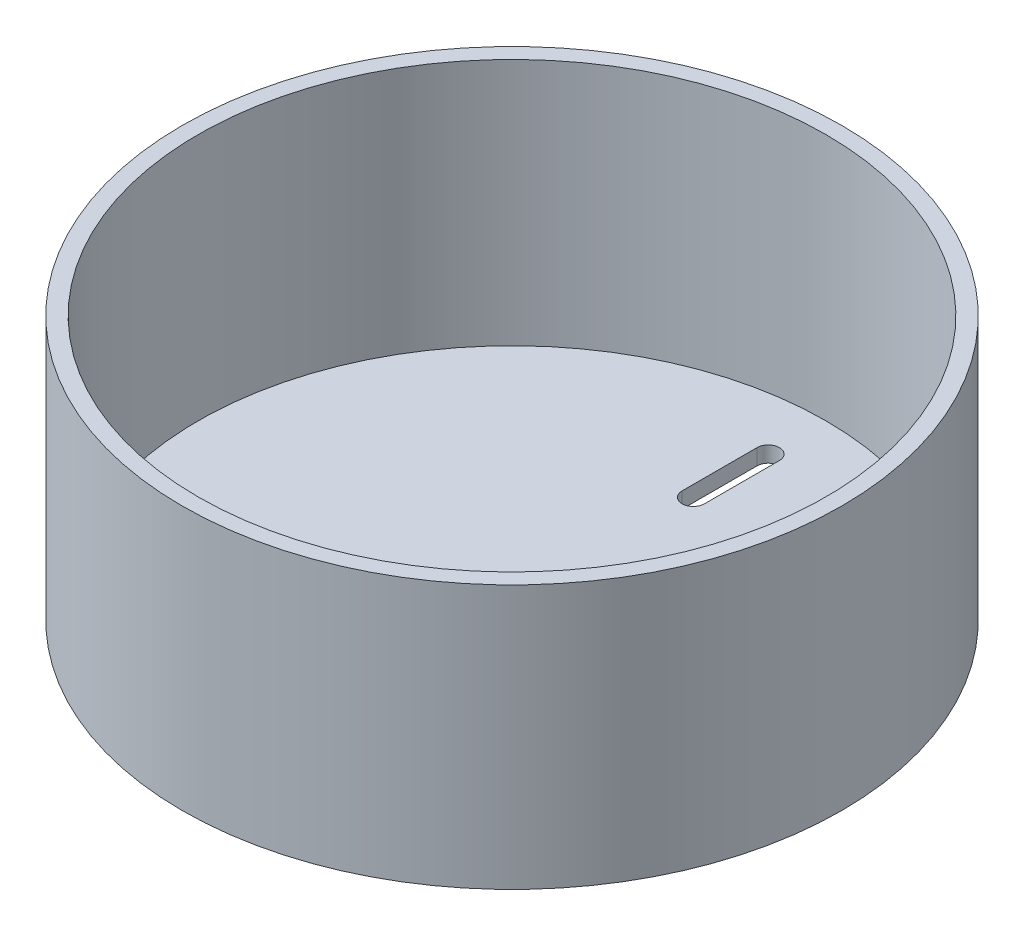
ISO-10303-21;
HEADER;
FILE_DESCRIPTION(('STEP AP214'),'2;1');
FILE_NAME('part.step','',(''),(''),'','','');
FILE_SCHEMA(('AUTOMOTIVE_DESIGN { 1 0 10303 214 1 1 1 1 }'));
ENDSEC;
DATA;
#1=APPLICATION_CONTEXT('core data for automotive mechanical design processes');
#2=APPLICATION_PROTOCOL_DEFINITION('international standard','automotive_design',2000,#1);
#3=PRODUCT_CONTEXT('',#1,'mechanical');
#4=PRODUCT('Part','Part','',(#3));
#5=PRODUCT_RELATED_PRODUCT_CATEGORY('part','',(#4));
#6=PRODUCT_DEFINITION_FORMATION('','',#4);
#7=PRODUCT_DEFINITION_CONTEXT('part definition',#1,'design');
#8=PRODUCT_DEFINITION('design','',#6,#7);
#9=PRODUCT_DEFINITION_SHAPE('','',#8);
#10=(LENGTH_UNIT() NAMED_UNIT(*) SI_UNIT(.MILLI.,.METRE.));
#11=(NAMED_UNIT(*) PLANE_ANGLE_UNIT() SI_UNIT($,.RADIAN.));
#12=(NAMED_UNIT(*) SI_UNIT($,.STERADIAN.) SOLID_ANGLE_UNIT());
#13=UNCERTAINTY_MEASURE_WITH_UNIT(LENGTH_MEASURE(1.E-05),#10,'distance_accuracy_value','');
#14=(GEOMETRIC_REPRESENTATION_CONTEXT(3) GLOBAL_UNCERTAINTY_ASSIGNED_CONTEXT((#13)) GLOBAL_UNIT_ASSIGNED_CONTEXT((#10,
#11,#12)) REPRESENTATION_CONTEXT('',''));
#15=CARTESIAN_POINT('',(0.,0.,0.));
#16=DIRECTION('',(0.,0.,1.));
#17=DIRECTION('',(1.,0.,0.));
#18=AXIS2_PLACEMENT_3D('',#15,#16,#17);
#19=CARTESIAN_POINT('',(0.,3.,0.));
#20=DIRECTION('',(0.,-1.,0.));
#21=DIRECTION('',(0.,0.,-1.));
#22=AXIS2_PLACEMENT_3D('',#19,#20,#21);
#23=CYLINDRICAL_SURFACE('',#22,62.5);
#24=CARTESIAN_POINT('',(0.,0.,0.));
#25=DIRECTION('',(0.,1.,0.));
#26=DIRECTION('',(0.,0.,1.));
#27=AXIS2_PLACEMENT_3D('',#24,#25,#26);
#28=CIRCLE('',#27,62.5);
#29=CARTESIAN_POINT('',(0.,0.,62.5));
#30=VERTEX_POINT('',#29);
#31=EDGE_CURVE('E107',#30,#30,#28,.T.);
#32=ORIENTED_EDGE('',*,*,#31,.T.);
#33=EDGE_LOOP('',(#32));
#34=FACE_BOUND('',#33,.T.);
#35=CARTESIAN_POINT('',(0.,50.,0.));
#36=DIRECTION('',(0.,1.,0.));
#37=DIRECTION('',(0.,0.,1.));
#38=AXIS2_PLACEMENT_3D('',#35,#36,#37);
#39=CIRCLE('',#38,62.5);
#40=CARTESIAN_POINT('',(0.,50.,62.5));
#41=VERTEX_POINT('',#40);
#42=EDGE_CURVE('E104',#41,#41,#39,.T.);
#43=ORIENTED_EDGE('',*,*,#42,.F.);
#44=EDGE_LOOP('',(#43));
#45=FACE_BOUND('',#44,.T.);
#46=ADVANCED_FACE('F34',(#34,#45),#23,.T.);
#47=CARTESIAN_POINT('',(0.,0.,0.));
#48=DIRECTION('',(0.,1.,0.));
#49=DIRECTION('',(0.,0.,1.));
#50=AXIS2_PLACEMENT_3D('',#47,#48,#49);
#51=PLANE('',#50);
#52=DIRECTION('',(0.,0.,1.));
#53=VECTOR('',#52,1.);
#54=CARTESIAN_POINT('',(2.12252478404842,0.,-48.5731633272615));
#55=LINE('',#54,#53);
#56=CARTESIAN_POINT('',(2.12252478404842,0.,-48.5731633272615));
#57=VERTEX_POINT('',#56);
#58=CARTESIAN_POINT('',(2.12252478404842,0.,-34.3685743878606));
#59=VERTEX_POINT('',#58);
#60=EDGE_CURVE('E85',#57,#59,#55,.T.);
#61=ORIENTED_EDGE('',*,*,#60,.F.);
#62=CARTESIAN_POINT('',(0.,0.,-48.5731633272615));
#63=DIRECTION('',(0.,-1.,0.));
#64=DIRECTION('',(0.,0.,-1.));
#65=AXIS2_PLACEMENT_3D('',#62,#63,#64);
#66=CIRCLE('',#65,2.12252478404842);
#67=CARTESIAN_POINT('',(-2.12252478404842,0.,-48.5731633272615));
#68=VERTEX_POINT('',#67);
#69=EDGE_CURVE('E48',#68,#57,#66,.T.);
#70=ORIENTED_EDGE('',*,*,#69,.F.);
#71=DIRECTION('',(0.,0.,-1.));
#72=VECTOR('',#71,1.);
#73=CARTESIAN_POINT('',(-2.12252478404842,0.,-48.5731633272615));
#74=LINE('',#73,#72);
#75=CARTESIAN_POINT('',(-2.12252478404842,0.,-34.3685743878606));
#76=VERTEX_POINT('',#75);
#77=EDGE_CURVE('E92',#76,#68,#74,.T.);
#78=ORIENTED_EDGE('',*,*,#77,.F.);
#79=CARTESIAN_POINT('',(0.,0.,-34.3685743878606));
#80=DIRECTION('',(0.,-1.,0.));
#81=DIRECTION('',(0.,0.,-1.));
#82=AXIS2_PLACEMENT_3D('',#79,#80,#81);
#83=CIRCLE('',#82,2.12252478404842);
#84=EDGE_CURVE('E76',#59,#76,#83,.T.);
#85=ORIENTED_EDGE('',*,*,#84,.F.);
#86=EDGE_LOOP('',(#61,#70,#78,#85));
#87=FACE_BOUND('',#86,.T.);
#88=ORIENTED_EDGE('',*,*,#31,.F.);
#89=EDGE_LOOP('',(#88));
#90=FACE_BOUND('',#89,.T.);
#91=ADVANCED_FACE('F89',(#87,#90),#51,.F.);
#92=CARTESIAN_POINT('',(0.,50.,0.));
#93=DIRECTION('',(0.,1.,0.));
#94=DIRECTION('',(0.,0.,1.));
#95=AXIS2_PLACEMENT_3D('',#92,#93,#94);
#96=PLANE('',#95);
#97=ORIENTED_EDGE('',*,*,#42,.T.);
#98=EDGE_LOOP('',(#97));
#99=FACE_BOUND('',#98,.T.);
#100=CARTESIAN_POINT('',(0.,50.,0.));
#101=DIRECTION('',(0.,1.,0.));
#102=DIRECTION('',(0.,0.,1.));
#103=AXIS2_PLACEMENT_3D('',#100,#101,#102);
#104=CIRCLE('',#103,59.5);
#105=CARTESIAN_POINT('',(0.,50.,59.5));
#106=VERTEX_POINT('',#105);
#107=EDGE_CURVE('E99',#106,#106,#104,.T.);
#108=ORIENTED_EDGE('',*,*,#107,.F.);
#109=EDGE_LOOP('',(#108));
#110=FACE_BOUND('',#109,.T.);
#111=ADVANCED_FACE('F140',(#99,#110),#96,.T.);
#112=CARTESIAN_POINT('',(0.,50.,0.));
#113=DIRECTION('',(0.,-1.,0.));
#114=DIRECTION('',(0.,0.,-1.));
#115=AXIS2_PLACEMENT_3D('',#112,#113,#114);
#116=CYLINDRICAL_SURFACE('',#115,59.5);
#117=CARTESIAN_POINT('',(0.,3.,0.));
#118=DIRECTION('',(0.,1.,0.));
#119=DIRECTION('',(0.,0.,1.));
#120=AXIS2_PLACEMENT_3D('',#117,#118,#119);
#121=CIRCLE('',#120,59.5);
#122=CARTESIAN_POINT('',(0.,3.,59.5));
#123=VERTEX_POINT('',#122);
#124=EDGE_CURVE('E108',#123,#123,#121,.F.);
#125=ORIENTED_EDGE('',*,*,#124,.T.);
#126=EDGE_LOOP('',(#125));
#127=FACE_BOUND('',#126,.T.);
#128=ORIENTED_EDGE('',*,*,#107,.T.);
#129=EDGE_LOOP('',(#128));
#130=FACE_BOUND('',#129,.T.);
#131=ADVANCED_FACE('F131',(#127,#130),#116,.F.);
#132=CARTESIAN_POINT('',(0.,3.,0.));
#133=DIRECTION('',(0.,1.,0.));
#134=DIRECTION('',(0.,0.,1.));
#135=AXIS2_PLACEMENT_3D('',#132,#133,#134);
#136=PLANE('',#135);
#137=CARTESIAN_POINT('',(0.,3.,-48.5731633272615));
#138=DIRECTION('',(0.,1.,0.));
#139=DIRECTION('',(0.,0.,1.));
#140=AXIS2_PLACEMENT_3D('',#137,#138,#139);
#141=CIRCLE('',#140,2.12252478404842);
#142=CARTESIAN_POINT('',(2.12252478404842,3.,-48.5731633272615));
#143=VERTEX_POINT('',#142);
#144=CARTESIAN_POINT('',(-2.12252478404842,3.,-48.5731633272615));
#145=VERTEX_POINT('',#144);
#146=EDGE_CURVE('E11',#143,#145,#141,.T.);
#147=ORIENTED_EDGE('',*,*,#146,.F.);
#148=DIRECTION('',(0.,0.,-1.));
#149=VECTOR('',#148,1.);
#150=CARTESIAN_POINT('',(2.12252478404842,3.,0.));
#151=LINE('',#150,#149);
#152=CARTESIAN_POINT('',(2.12252478404842,3.,-34.3685743878606));
#153=VERTEX_POINT('',#152);
#154=EDGE_CURVE('E111',#153,#143,#151,.T.);
#155=ORIENTED_EDGE('',*,*,#154,.F.);
#156=CARTESIAN_POINT('',(0.,3.,-34.3685743878606));
#157=DIRECTION('',(0.,1.,0.));
#158=DIRECTION('',(0.,0.,1.));
#159=AXIS2_PLACEMENT_3D('',#156,#157,#158);
#160=CIRCLE('',#159,2.12252478404842);
#161=CARTESIAN_POINT('',(-2.12252478404842,3.,-34.3685743878606));
#162=VERTEX_POINT('',#161);
#163=EDGE_CURVE('E79',#162,#153,#160,.T.);
#164=ORIENTED_EDGE('',*,*,#163,.F.);
#165=DIRECTION('',(0.,0.,1.));
#166=VECTOR('',#165,1.);
#167=CARTESIAN_POINT('',(-2.12252478404842,3.,0.));
#168=LINE('',#167,#166);
#169=EDGE_CURVE('E41',#145,#162,#168,.T.);
#170=ORIENTED_EDGE('',*,*,#169,.F.);
#171=EDGE_LOOP('',(#147,#155,#164,#170));
#172=FACE_BOUND('',#171,.T.);
#173=ORIENTED_EDGE('',*,*,#124,.F.);
#174=EDGE_LOOP('',(#173));
#175=FACE_BOUND('',#174,.T.);
#176=ADVANCED_FACE('F121',(#172,#175),#136,.T.);
#177=CARTESIAN_POINT('',(0.,50.,-48.5731633272615));
#178=DIRECTION('',(0.,-1.,0.));
#179=DIRECTION('',(0.,0.,-1.));
#180=AXIS2_PLACEMENT_3D('',#177,#178,#179);
#181=CYLINDRICAL_SURFACE('',#180,2.12252478404842);
#182=ORIENTED_EDGE('',*,*,#146,.T.);
#183=DIRECTION('',(0.,-1.,0.));
#184=VECTOR('',#183,1.);
#185=CARTESIAN_POINT('',(-2.12252478404842,50.,-48.5731633272615));
#186=LINE('',#185,#184);
#187=EDGE_CURVE('E97',#145,#68,#186,.T.);
#188=ORIENTED_EDGE('',*,*,#187,.T.);
#189=ORIENTED_EDGE('',*,*,#69,.T.);
#190=DIRECTION('',(0.,-1.,0.));
#191=VECTOR('',#190,1.);
#192=CARTESIAN_POINT('',(2.12252478404842,50.,-48.5731633272615));
#193=LINE('',#192,#191);
#194=EDGE_CURVE('E82',#143,#57,#193,.T.);
#195=ORIENTED_EDGE('',*,*,#194,.F.);
#196=EDGE_LOOP('',(#182,#188,#189,#195));
#197=FACE_BOUND('',#196,.T.);
#198=ADVANCED_FACE('F123',(#197),#181,.F.);
#199=CARTESIAN_POINT('',(-2.12252478404842,50.,-48.5731633272615));
#200=DIRECTION('',(-1.,0.,0.));
#201=DIRECTION('',(0.,0.,1.));
#202=AXIS2_PLACEMENT_3D('',#199,#200,#201);
#203=PLANE('',#202);
#204=ORIENTED_EDGE('',*,*,#169,.T.);
#205=DIRECTION('',(0.,-1.,0.));
#206=VECTOR('',#205,1.);
#207=CARTESIAN_POINT('',(-2.12252478404842,50.,-34.3685743878606));
#208=LINE('',#207,#206);
#209=EDGE_CURVE('E81',#162,#76,#208,.T.);
#210=ORIENTED_EDGE('',*,*,#209,.T.);
#211=ORIENTED_EDGE('',*,*,#77,.T.);
#212=ORIENTED_EDGE('',*,*,#187,.F.);
#213=EDGE_LOOP('',(#204,#210,#211,#212));
#214=FACE_BOUND('',#213,.T.);
#215=ADVANCED_FACE('F118',(#214),#203,.F.);
#216=CARTESIAN_POINT('',(0.,50.,-34.3685743878606));
#217=DIRECTION('',(0.,-1.,0.));
#218=DIRECTION('',(0.,0.,-1.));
#219=AXIS2_PLACEMENT_3D('',#216,#217,#218);
#220=CYLINDRICAL_SURFACE('',#219,2.12252478404842);
#221=ORIENTED_EDGE('',*,*,#163,.T.);
#222=DIRECTION('',(0.,-1.,0.));
#223=VECTOR('',#222,1.);
#224=CARTESIAN_POINT('',(2.12252478404842,50.,-34.3685743878606));
#225=LINE('',#224,#223);
#226=EDGE_CURVE('E56',#153,#59,#225,.T.);
#227=ORIENTED_EDGE('',*,*,#226,.T.);
#228=ORIENTED_EDGE('',*,*,#84,.T.);
#229=ORIENTED_EDGE('',*,*,#209,.F.);
#230=EDGE_LOOP('',(#221,#227,#228,#229));
#231=FACE_BOUND('',#230,.T.);
#232=ADVANCED_FACE('F73',(#231),#220,.F.);
#233=CARTESIAN_POINT('',(2.12252478404842,50.,-48.5731633272615));
#234=DIRECTION('',(1.,0.,0.));
#235=DIRECTION('',(0.,0.,-1.));
#236=AXIS2_PLACEMENT_3D('',#233,#234,#235);
#237=PLANE('',#236);
#238=ORIENTED_EDGE('',*,*,#154,.T.);
#239=ORIENTED_EDGE('',*,*,#194,.T.);
#240=ORIENTED_EDGE('',*,*,#60,.T.);
#241=ORIENTED_EDGE('',*,*,#226,.F.);
#242=EDGE_LOOP('',(#238,#239,#240,#241));
#243=FACE_BOUND('',#242,.T.);
#244=ADVANCED_FACE('F86',(#243),#237,.F.);
#245=CLOSED_SHELL('',(#46,#91,#111,#131,#176,#198,#215,#232,#244));
#246=MANIFOLD_SOLID_BREP('B2',#245);
#247=ADVANCED_BREP_SHAPE_REPRESENTATION('',(#18,#246),#14);
#248=SHAPE_DEFINITION_REPRESENTATION(#9,#247);
ENDSEC;
END-ISO-10303-21;
